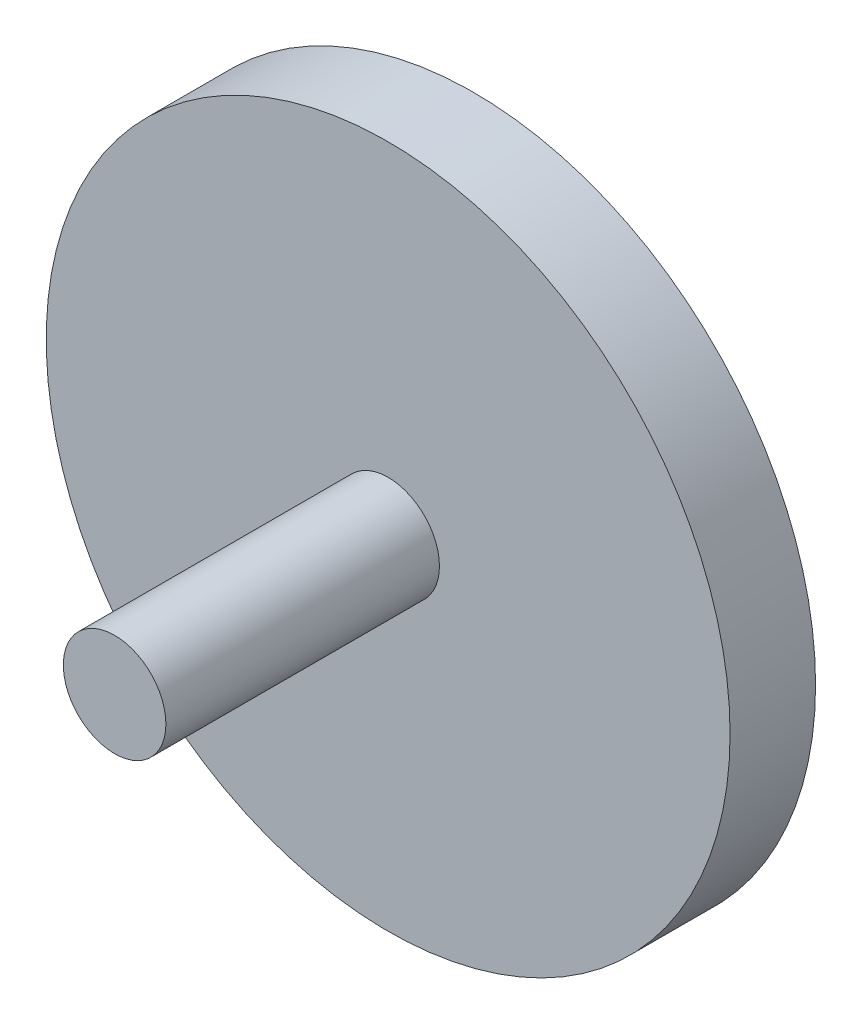
ISO-10303-21;
HEADER;
FILE_DESCRIPTION(('STEP AP214'),'2;1');
FILE_NAME('part.step','',(''),(''),'','','');
FILE_SCHEMA(('AUTOMOTIVE_DESIGN { 1 0 10303 214 1 1 1 1 }'));
ENDSEC;
DATA;
#1=APPLICATION_CONTEXT('core data for automotive mechanical design processes');
#2=APPLICATION_PROTOCOL_DEFINITION('international standard','automotive_design',2000,#1);
#3=PRODUCT_CONTEXT('',#1,'mechanical');
#4=PRODUCT('Part','Part','',(#3));
#5=PRODUCT_RELATED_PRODUCT_CATEGORY('part','',(#4));
#6=PRODUCT_DEFINITION_FORMATION('','',#4);
#7=PRODUCT_DEFINITION_CONTEXT('part definition',#1,'design');
#8=PRODUCT_DEFINITION('design','',#6,#7);
#9=PRODUCT_DEFINITION_SHAPE('','',#8);
#10=(LENGTH_UNIT() NAMED_UNIT(*) SI_UNIT(.MILLI.,.METRE.));
#11=(NAMED_UNIT(*) PLANE_ANGLE_UNIT() SI_UNIT($,.RADIAN.));
#12=(NAMED_UNIT(*) SI_UNIT($,.STERADIAN.) SOLID_ANGLE_UNIT());
#13=UNCERTAINTY_MEASURE_WITH_UNIT(LENGTH_MEASURE(1.E-05),#10,'distance_accuracy_value','');
#14=(GEOMETRIC_REPRESENTATION_CONTEXT(3) GLOBAL_UNCERTAINTY_ASSIGNED_CONTEXT((#13)) GLOBAL_UNIT_ASSIGNED_CONTEXT((#10,
#11,#12)) REPRESENTATION_CONTEXT('',''));
#15=CARTESIAN_POINT('',(0.,0.,0.));
#16=DIRECTION('',(0.,0.,1.));
#17=DIRECTION('',(1.,0.,0.));
#18=AXIS2_PLACEMENT_3D('',#15,#16,#17);
#19=CARTESIAN_POINT('',(0.,0.,25.));
#20=DIRECTION('',(0.,0.,-1.));
#21=DIRECTION('',(-1.,0.,0.));
#22=AXIS2_PLACEMENT_3D('',#19,#20,#21);
#23=CYLINDRICAL_SURFACE('',#22,100.);
#24=CARTESIAN_POINT('',(0.,0.,25.));
#25=DIRECTION('',(0.,0.,1.));
#26=DIRECTION('',(1.,0.,0.));
#27=AXIS2_PLACEMENT_3D('',#24,#25,#26);
#28=CIRCLE('',#27,100.);
#29=CARTESIAN_POINT('',(100.,0.,25.));
#30=VERTEX_POINT('',#29);
#31=EDGE_CURVE('E44',#30,#30,#28,.T.);
#32=ORIENTED_EDGE('',*,*,#31,.F.);
#33=EDGE_LOOP('',(#32));
#34=FACE_BOUND('',#33,.T.);
#35=CARTESIAN_POINT('',(0.,0.,0.));
#36=DIRECTION('',(0.,0.,1.));
#37=DIRECTION('',(1.,0.,0.));
#38=AXIS2_PLACEMENT_3D('',#35,#36,#37);
#39=CIRCLE('',#38,100.);
#40=CARTESIAN_POINT('',(100.,0.,0.));
#41=VERTEX_POINT('',#40);
#42=EDGE_CURVE('E39',#41,#41,#39,.T.);
#43=ORIENTED_EDGE('',*,*,#42,.T.);
#44=EDGE_LOOP('',(#43));
#45=FACE_BOUND('',#44,.T.);
#46=ADVANCED_FACE('F36',(#34,#45),#23,.T.);
#47=CARTESIAN_POINT('',(0.,0.,25.));
#48=DIRECTION('',(0.,0.,1.));
#49=DIRECTION('',(1.,0.,0.));
#50=AXIS2_PLACEMENT_3D('',#47,#48,#49);
#51=PLANE('',#50);
#52=CARTESIAN_POINT('',(0.,0.,25.));
#53=DIRECTION('',(0.,0.,1.));
#54=DIRECTION('',(1.,0.,0.));
#55=AXIS2_PLACEMENT_3D('',#52,#53,#54);
#56=CIRCLE('',#55,15.);
#57=CARTESIAN_POINT('',(15.,0.,25.));
#58=VERTEX_POINT('',#57);
#59=EDGE_CURVE('E10',#58,#58,#56,.T.);
#60=ORIENTED_EDGE('',*,*,#59,.F.);
#61=EDGE_LOOP('',(#60));
#62=FACE_BOUND('',#61,.T.);
#63=ORIENTED_EDGE('',*,*,#31,.T.);
#64=EDGE_LOOP('',(#63));
#65=FACE_BOUND('',#64,.T.);
#66=ADVANCED_FACE('F77',(#62,#65),#51,.T.);
#67=CARTESIAN_POINT('',(0.,0.,0.));
#68=DIRECTION('',(0.,0.,1.));
#69=DIRECTION('',(1.,0.,0.));
#70=AXIS2_PLACEMENT_3D('',#67,#68,#69);
#71=PLANE('',#70);
#72=CARTESIAN_POINT('',(0.,50.,0.));
#73=DIRECTION('',(0.,0.,-1.));
#74=DIRECTION('',(-1.,0.,0.));
#75=AXIS2_PLACEMENT_3D('',#72,#73,#74);
#76=CIRCLE('',#75,10.);
#77=CARTESIAN_POINT('',(-10.,50.,0.));
#78=VERTEX_POINT('',#77);
#79=EDGE_CURVE('E56',#78,#78,#76,.T.);
#80=ORIENTED_EDGE('',*,*,#79,.F.);
#81=EDGE_LOOP('',(#80));
#82=FACE_BOUND('',#81,.T.);
#83=ORIENTED_EDGE('',*,*,#42,.F.);
#84=EDGE_LOOP('',(#83));
#85=FACE_BOUND('',#84,.T.);
#86=ADVANCED_FACE('F73',(#82,#85),#71,.F.);
#87=CARTESIAN_POINT('',(0.,0.,105.));
#88=DIRECTION('',(0.,0.,-1.));
#89=DIRECTION('',(-1.,0.,0.));
#90=AXIS2_PLACEMENT_3D('',#87,#88,#89);
#91=CYLINDRICAL_SURFACE('',#90,15.);
#92=CARTESIAN_POINT('',(0.,0.,105.));
#93=DIRECTION('',(0.,0.,1.));
#94=DIRECTION('',(1.,0.,0.));
#95=AXIS2_PLACEMENT_3D('',#92,#93,#94);
#96=CIRCLE('',#95,15.);
#97=CARTESIAN_POINT('',(15.,0.,105.));
#98=VERTEX_POINT('',#97);
#99=EDGE_CURVE('E51',#98,#98,#96,.T.);
#100=ORIENTED_EDGE('',*,*,#99,.F.);
#101=EDGE_LOOP('',(#100));
#102=FACE_BOUND('',#101,.T.);
#103=ORIENTED_EDGE('',*,*,#59,.T.);
#104=EDGE_LOOP('',(#103));
#105=FACE_BOUND('',#104,.T.);
#106=ADVANCED_FACE('F76',(#102,#105),#91,.T.);
#107=CARTESIAN_POINT('',(0.,0.,105.));
#108=DIRECTION('',(0.,0.,1.));
#109=DIRECTION('',(1.,0.,0.));
#110=AXIS2_PLACEMENT_3D('',#107,#108,#109);
#111=PLANE('',#110);
#112=ORIENTED_EDGE('',*,*,#99,.T.);
#113=EDGE_LOOP('',(#112));
#114=FACE_BOUND('',#113,.T.);
#115=ADVANCED_FACE('F69',(#114),#111,.T.);
#116=CARTESIAN_POINT('',(0.,50.,5.));
#117=DIRECTION('',(0.,0.,-1.));
#118=DIRECTION('',(-1.,0.,0.));
#119=AXIS2_PLACEMENT_3D('',#116,#117,#118);
#120=CYLINDRICAL_SURFACE('',#119,10.);
#121=CARTESIAN_POINT('',(0.,50.,5.));
#122=DIRECTION('',(0.,0.,-1.));
#123=DIRECTION('',(-1.,0.,0.));
#124=AXIS2_PLACEMENT_3D('',#121,#122,#123);
#125=CIRCLE('',#124,10.);
#126=CARTESIAN_POINT('',(-10.,50.,5.));
#127=VERTEX_POINT('',#126);
#128=EDGE_CURVE('E55',#127,#127,#125,.T.);
#129=ORIENTED_EDGE('',*,*,#128,.F.);
#130=EDGE_LOOP('',(#129));
#131=FACE_BOUND('',#130,.T.);
#132=ORIENTED_EDGE('',*,*,#79,.T.);
#133=EDGE_LOOP('',(#132));
#134=FACE_BOUND('',#133,.T.);
#135=ADVANCED_FACE('F66',(#131,#134),#120,.F.);
#136=CARTESIAN_POINT('',(0.,50.,5.));
#137=DIRECTION('',(0.,0.,-1.));
#138=DIRECTION('',(-1.,0.,0.));
#139=AXIS2_PLACEMENT_3D('',#136,#137,#138);
#140=PLANE('',#139);
#141=ORIENTED_EDGE('',*,*,#128,.T.);
#142=EDGE_LOOP('',(#141));
#143=FACE_BOUND('',#142,.T.);
#144=ADVANCED_FACE('F64',(#143),#140,.T.);
#145=CLOSED_SHELL('',(#46,#66,#86,#106,#115,#135,#144));
#146=MANIFOLD_SOLID_BREP('B2',#145);
#147=ADVANCED_BREP_SHAPE_REPRESENTATION('',(#18,#146),#14);
#148=SHAPE_DEFINITION_REPRESENTATION(#9,#147);
ENDSEC;
END-ISO-10303-21;
